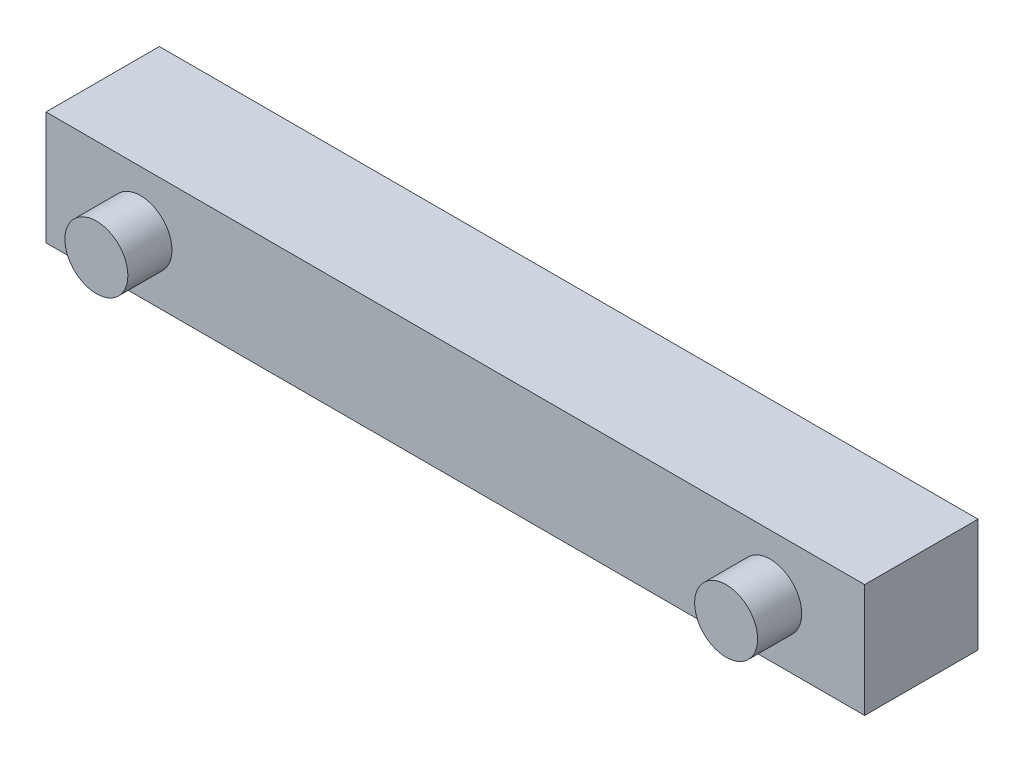
ISO-10303-21;
HEADER;
FILE_DESCRIPTION(('STEP AP214'),'2;1');
FILE_NAME('part.step','',(''),(''),'','','');
FILE_SCHEMA(('AUTOMOTIVE_DESIGN { 1 0 10303 214 1 1 1 1 }'));
ENDSEC;
DATA;
#1=APPLICATION_CONTEXT('core data for automotive mechanical design processes');
#2=APPLICATION_PROTOCOL_DEFINITION('international standard','automotive_design',2000,#1);
#3=PRODUCT_CONTEXT('',#1,'mechanical');
#4=PRODUCT('Part','Part','',(#3));
#5=PRODUCT_RELATED_PRODUCT_CATEGORY('part','',(#4));
#6=PRODUCT_DEFINITION_FORMATION('','',#4);
#7=PRODUCT_DEFINITION_CONTEXT('part definition',#1,'design');
#8=PRODUCT_DEFINITION('design','',#6,#7);
#9=PRODUCT_DEFINITION_SHAPE('','',#8);
#10=(LENGTH_UNIT() NAMED_UNIT(*) SI_UNIT(.MILLI.,.METRE.));
#11=(NAMED_UNIT(*) PLANE_ANGLE_UNIT() SI_UNIT($,.RADIAN.));
#12=(NAMED_UNIT(*) SI_UNIT($,.STERADIAN.) SOLID_ANGLE_UNIT());
#13=UNCERTAINTY_MEASURE_WITH_UNIT(LENGTH_MEASURE(1.E-05),#10,'distance_accuracy_value','');
#14=(GEOMETRIC_REPRESENTATION_CONTEXT(3) GLOBAL_UNCERTAINTY_ASSIGNED_CONTEXT((#13)) GLOBAL_UNIT_ASSIGNED_CONTEXT((#10,
#11,#12)) REPRESENTATION_CONTEXT('',''));
#15=CARTESIAN_POINT('',(0.,0.,0.));
#16=DIRECTION('',(0.,0.,1.));
#17=DIRECTION('',(1.,0.,0.));
#18=AXIS2_PLACEMENT_3D('',#15,#16,#17);
#19=CARTESIAN_POINT('',(0.,0.,9.));
#20=DIRECTION('',(1.,0.,0.));
#21=DIRECTION('',(0.,0.,-1.));
#22=AXIS2_PLACEMENT_3D('',#19,#20,#21);
#23=PLANE('',#22);
#24=DIRECTION('',(0.,-1.,0.));
#25=VECTOR('',#24,1.);
#26=CARTESIAN_POINT('',(0.,0.,0.));
#27=LINE('',#26,#25);
#28=CARTESIAN_POINT('',(0.,9.,0.));
#29=VERTEX_POINT('',#28);
#30=CARTESIAN_POINT('',(0.,0.,0.));
#31=VERTEX_POINT('',#30);
#32=EDGE_CURVE('E100',#29,#31,#27,.T.);
#33=ORIENTED_EDGE('',*,*,#32,.T.);
#34=DIRECTION('',(0.,0.,-1.));
#35=VECTOR('',#34,1.);
#36=CARTESIAN_POINT('',(0.,0.,9.));
#37=LINE('',#36,#35);
#38=CARTESIAN_POINT('',(0.,0.,9.));
#39=VERTEX_POINT('',#38);
#40=EDGE_CURVE('E91',#39,#31,#37,.T.);
#41=ORIENTED_EDGE('',*,*,#40,.F.);
#42=DIRECTION('',(0.,-1.,0.));
#43=VECTOR('',#42,1.);
#44=CARTESIAN_POINT('',(0.,0.,9.));
#45=LINE('',#44,#43);
#46=CARTESIAN_POINT('',(0.,9.,9.));
#47=VERTEX_POINT('',#46);
#48=EDGE_CURVE('E85',#47,#39,#45,.T.);
#49=ORIENTED_EDGE('',*,*,#48,.F.);
#50=DIRECTION('',(0.,0.,-1.));
#51=VECTOR('',#50,1.);
#52=CARTESIAN_POINT('',(0.,9.,9.));
#53=LINE('',#52,#51);
#54=EDGE_CURVE('E96',#47,#29,#53,.T.);
#55=ORIENTED_EDGE('',*,*,#54,.T.);
#56=EDGE_LOOP('',(#33,#41,#49,#55));
#57=FACE_BOUND('',#56,.T.);
#58=ADVANCED_FACE('F33',(#57),#23,.F.);
#59=CARTESIAN_POINT('',(0.,0.,9.));
#60=DIRECTION('',(0.,1.,0.));
#61=DIRECTION('',(0.,0.,1.));
#62=AXIS2_PLACEMENT_3D('',#59,#60,#61);
#63=PLANE('',#62);
#64=DIRECTION('',(1.,0.,0.));
#65=VECTOR('',#64,1.);
#66=CARTESIAN_POINT('',(0.,0.,0.));
#67=LINE('',#66,#65);
#68=CARTESIAN_POINT('',(65.,0.,0.));
#69=VERTEX_POINT('',#68);
#70=EDGE_CURVE('E90',#31,#69,#67,.T.);
#71=ORIENTED_EDGE('',*,*,#70,.T.);
#72=DIRECTION('',(0.,0.,-1.));
#73=VECTOR('',#72,1.);
#74=CARTESIAN_POINT('',(65.,0.,9.));
#75=LINE('',#74,#73);
#76=CARTESIAN_POINT('',(65.,0.,9.));
#77=VERTEX_POINT('',#76);
#78=EDGE_CURVE('E88',#77,#69,#75,.T.);
#79=ORIENTED_EDGE('',*,*,#78,.F.);
#80=DIRECTION('',(1.,0.,0.));
#81=VECTOR('',#80,1.);
#82=CARTESIAN_POINT('',(0.,0.,9.));
#83=LINE('',#82,#81);
#84=EDGE_CURVE('E80',#39,#77,#83,.T.);
#85=ORIENTED_EDGE('',*,*,#84,.F.);
#86=ORIENTED_EDGE('',*,*,#40,.T.);
#87=EDGE_LOOP('',(#71,#79,#85,#86));
#88=FACE_BOUND('',#87,.T.);
#89=ADVANCED_FACE('F89',(#88),#63,.F.);
#90=CARTESIAN_POINT('',(65.,0.,9.));
#91=DIRECTION('',(-1.,0.,0.));
#92=DIRECTION('',(0.,0.,1.));
#93=AXIS2_PLACEMENT_3D('',#90,#91,#92);
#94=PLANE('',#93);
#95=DIRECTION('',(0.,1.,0.));
#96=VECTOR('',#95,1.);
#97=CARTESIAN_POINT('',(65.,0.,0.));
#98=LINE('',#97,#96);
#99=CARTESIAN_POINT('',(65.,9.,0.));
#100=VERTEX_POINT('',#99);
#101=EDGE_CURVE('E66',#69,#100,#98,.T.);
#102=ORIENTED_EDGE('',*,*,#101,.T.);
#103=DIRECTION('',(0.,0.,-1.));
#104=VECTOR('',#103,1.);
#105=CARTESIAN_POINT('',(65.,9.,9.));
#106=LINE('',#105,#104);
#107=CARTESIAN_POINT('',(65.,9.,9.));
#108=VERTEX_POINT('',#107);
#109=EDGE_CURVE('E92',#108,#100,#106,.T.);
#110=ORIENTED_EDGE('',*,*,#109,.F.);
#111=DIRECTION('',(0.,1.,0.));
#112=VECTOR('',#111,1.);
#113=CARTESIAN_POINT('',(65.,0.,9.));
#114=LINE('',#113,#112);
#115=EDGE_CURVE('E83',#77,#108,#114,.T.);
#116=ORIENTED_EDGE('',*,*,#115,.F.);
#117=ORIENTED_EDGE('',*,*,#78,.T.);
#118=EDGE_LOOP('',(#102,#110,#116,#117));
#119=FACE_BOUND('',#118,.T.);
#120=ADVANCED_FACE('F94',(#119),#94,.F.);
#121=CARTESIAN_POINT('',(0.,9.,9.));
#122=DIRECTION('',(0.,-1.,0.));
#123=DIRECTION('',(0.,0.,-1.));
#124=AXIS2_PLACEMENT_3D('',#121,#122,#123);
#125=PLANE('',#124);
#126=DIRECTION('',(-1.,0.,0.));
#127=VECTOR('',#126,1.);
#128=CARTESIAN_POINT('',(0.,9.,0.));
#129=LINE('',#128,#127);
#130=EDGE_CURVE('E72',#100,#29,#129,.T.);
#131=ORIENTED_EDGE('',*,*,#130,.T.);
#132=ORIENTED_EDGE('',*,*,#54,.F.);
#133=DIRECTION('',(-1.,0.,0.));
#134=VECTOR('',#133,1.);
#135=CARTESIAN_POINT('',(0.,9.,9.));
#136=LINE('',#135,#134);
#137=EDGE_CURVE('E49',#108,#47,#136,.T.);
#138=ORIENTED_EDGE('',*,*,#137,.F.);
#139=ORIENTED_EDGE('',*,*,#109,.T.);
#140=EDGE_LOOP('',(#131,#132,#138,#139));
#141=FACE_BOUND('',#140,.T.);
#142=ADVANCED_FACE('F116',(#141),#125,.F.);
#143=CARTESIAN_POINT('',(0.,0.,9.));
#144=DIRECTION('',(0.,0.,-1.));
#145=DIRECTION('',(-1.,0.,0.));
#146=AXIS2_PLACEMENT_3D('',#143,#144,#145);
#147=PLANE('',#146);
#148=CARTESIAN_POINT('',(57.5,4.5,9.));
#149=DIRECTION('',(0.,0.,-1.));
#150=DIRECTION('',(-1.,0.,0.));
#151=AXIS2_PLACEMENT_3D('',#148,#149,#150);
#152=CIRCLE('',#151,2.5);
#153=CARTESIAN_POINT('',(55.,4.5,9.));
#154=VERTEX_POINT('',#153);
#155=EDGE_CURVE('E11',#154,#154,#152,.F.);
#156=ORIENTED_EDGE('',*,*,#155,.F.);
#157=EDGE_LOOP('',(#156));
#158=FACE_BOUND('',#157,.T.);
#159=CARTESIAN_POINT('',(7.5,4.5,9.));
#160=DIRECTION('',(0.,0.,-1.));
#161=DIRECTION('',(-1.,0.,0.));
#162=AXIS2_PLACEMENT_3D('',#159,#160,#161);
#163=CIRCLE('',#162,2.5);
#164=CARTESIAN_POINT('',(5.,4.5,9.));
#165=VERTEX_POINT('',#164);
#166=EDGE_CURVE('E41',#165,#165,#163,.F.);
#167=ORIENTED_EDGE('',*,*,#166,.F.);
#168=EDGE_LOOP('',(#167));
#169=FACE_BOUND('',#168,.T.);
#170=ORIENTED_EDGE('',*,*,#48,.T.);
#171=ORIENTED_EDGE('',*,*,#84,.T.);
#172=ORIENTED_EDGE('',*,*,#115,.T.);
#173=ORIENTED_EDGE('',*,*,#137,.T.);
#174=EDGE_LOOP('',(#170,#171,#172,#173));
#175=FACE_BOUND('',#174,.T.);
#176=ADVANCED_FACE('F81',(#158,#169,#175),#147,.F.);
#177=CARTESIAN_POINT('',(0.,0.,0.));
#178=DIRECTION('',(0.,0.,-1.));
#179=DIRECTION('',(-1.,0.,0.));
#180=AXIS2_PLACEMENT_3D('',#177,#178,#179);
#181=PLANE('',#180);
#182=ORIENTED_EDGE('',*,*,#32,.F.);
#183=ORIENTED_EDGE('',*,*,#130,.F.);
#184=ORIENTED_EDGE('',*,*,#101,.F.);
#185=ORIENTED_EDGE('',*,*,#70,.F.);
#186=EDGE_LOOP('',(#182,#183,#184,#185));
#187=FACE_BOUND('',#186,.T.);
#188=ADVANCED_FACE('F115',(#187),#181,.T.);
#189=CARTESIAN_POINT('',(7.5,4.5,12.5));
#190=DIRECTION('',(0.,0.,-1.));
#191=DIRECTION('',(-1.,0.,0.));
#192=AXIS2_PLACEMENT_3D('',#189,#190,#191);
#193=CYLINDRICAL_SURFACE('',#192,2.5);
#194=CARTESIAN_POINT('',(7.5,4.5,12.5));
#195=DIRECTION('',(0.,0.,1.));
#196=DIRECTION('',(1.,0.,0.));
#197=AXIS2_PLACEMENT_3D('',#194,#195,#196);
#198=CIRCLE('',#197,2.5);
#199=CARTESIAN_POINT('',(10.,4.5,12.5));
#200=VERTEX_POINT('',#199);
#201=EDGE_CURVE('E103',#200,#200,#198,.T.);
#202=ORIENTED_EDGE('',*,*,#201,.F.);
#203=EDGE_LOOP('',(#202));
#204=FACE_BOUND('',#203,.T.);
#205=ORIENTED_EDGE('',*,*,#166,.T.);
#206=EDGE_LOOP('',(#205));
#207=FACE_BOUND('',#206,.T.);
#208=ADVANCED_FACE('F112',(#204,#207),#193,.T.);
#209=CARTESIAN_POINT('',(7.5,4.5,12.5));
#210=DIRECTION('',(0.,0.,1.));
#211=DIRECTION('',(1.,0.,0.));
#212=AXIS2_PLACEMENT_3D('',#209,#210,#211);
#213=PLANE('',#212);
#214=ORIENTED_EDGE('',*,*,#201,.T.);
#215=EDGE_LOOP('',(#214));
#216=FACE_BOUND('',#215,.T.);
#217=ADVANCED_FACE('F146',(#216),#213,.T.);
#218=CARTESIAN_POINT('',(57.5,4.5,12.5));
#219=DIRECTION('',(0.,0.,-1.));
#220=DIRECTION('',(-1.,0.,0.));
#221=AXIS2_PLACEMENT_3D('',#218,#219,#220);
#222=CYLINDRICAL_SURFACE('',#221,2.5);
#223=CARTESIAN_POINT('',(57.5,4.5,12.5));
#224=DIRECTION('',(0.,0.,1.));
#225=DIRECTION('',(1.,0.,0.));
#226=AXIS2_PLACEMENT_3D('',#223,#224,#225);
#227=CIRCLE('',#226,2.5);
#228=CARTESIAN_POINT('',(60.,4.5,12.5));
#229=VERTEX_POINT('',#228);
#230=EDGE_CURVE('E137',#229,#229,#227,.T.);
#231=ORIENTED_EDGE('',*,*,#230,.F.);
#232=EDGE_LOOP('',(#231));
#233=FACE_BOUND('',#232,.T.);
#234=ORIENTED_EDGE('',*,*,#155,.T.);
#235=EDGE_LOOP('',(#234));
#236=FACE_BOUND('',#235,.T.);
#237=ADVANCED_FACE('F143',(#233,#236),#222,.T.);
#238=CARTESIAN_POINT('',(57.5,4.5,12.5));
#239=DIRECTION('',(0.,0.,1.));
#240=DIRECTION('',(1.,0.,0.));
#241=AXIS2_PLACEMENT_3D('',#238,#239,#240);
#242=PLANE('',#241);
#243=ORIENTED_EDGE('',*,*,#230,.T.);
#244=EDGE_LOOP('',(#243));
#245=FACE_BOUND('',#244,.T.);
#246=ADVANCED_FACE('F141',(#245),#242,.T.);
#247=CLOSED_SHELL('',(#58,#89,#120,#142,#176,#188,#208,#217,#237,#246));
#248=MANIFOLD_SOLID_BREP('B2',#247);
#249=ADVANCED_BREP_SHAPE_REPRESENTATION('',(#18,#248),#14);
#250=SHAPE_DEFINITION_REPRESENTATION(#9,#249);
ENDSEC;
END-ISO-10303-21;
